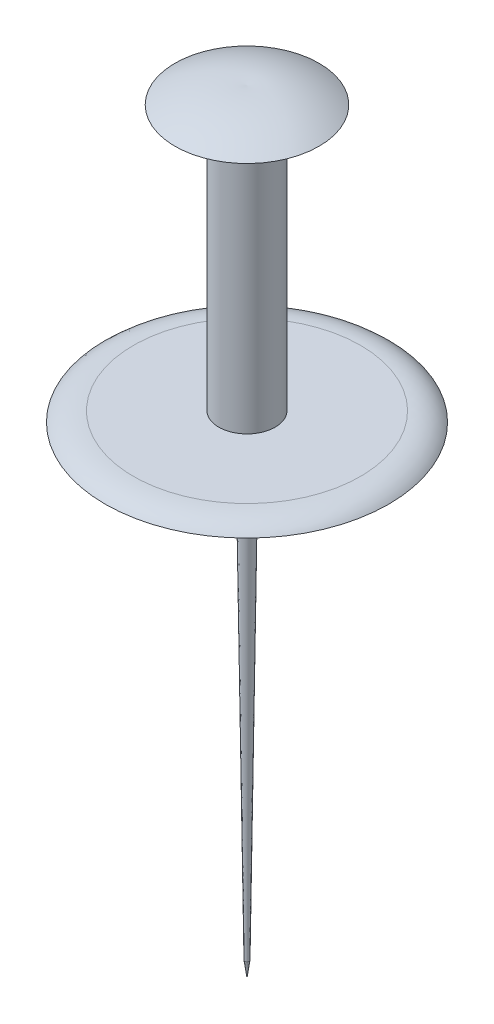
ISO-10303-21;
HEADER;
FILE_DESCRIPTION(('STEP AP214'),'2;1');
FILE_NAME('part.step','',(''),(''),'','','');
FILE_SCHEMA(('AUTOMOTIVE_DESIGN { 1 0 10303 214 1 1 1 1 }'));
ENDSEC;
DATA;
#1=APPLICATION_CONTEXT('core data for automotive mechanical design processes');
#2=APPLICATION_PROTOCOL_DEFINITION('international standard','automotive_design',2000,#1);
#3=PRODUCT_CONTEXT('',#1,'mechanical');
#4=PRODUCT('Part','Part','',(#3));
#5=PRODUCT_RELATED_PRODUCT_CATEGORY('part','',(#4));
#6=PRODUCT_DEFINITION_FORMATION('','',#4);
#7=PRODUCT_DEFINITION_CONTEXT('part definition',#1,'design');
#8=PRODUCT_DEFINITION('design','',#6,#7);
#9=PRODUCT_DEFINITION_SHAPE('','',#8);
#10=(LENGTH_UNIT() NAMED_UNIT(*) SI_UNIT(.MILLI.,.METRE.));
#11=(NAMED_UNIT(*) PLANE_ANGLE_UNIT() SI_UNIT($,.RADIAN.));
#12=(NAMED_UNIT(*) SI_UNIT($,.STERADIAN.) SOLID_ANGLE_UNIT());
#13=UNCERTAINTY_MEASURE_WITH_UNIT(LENGTH_MEASURE(1.E-05),#10,'distance_accuracy_value','');
#14=(GEOMETRIC_REPRESENTATION_CONTEXT(3) GLOBAL_UNCERTAINTY_ASSIGNED_CONTEXT((#13)) GLOBAL_UNIT_ASSIGNED_CONTEXT((#10,
#11,#12)) REPRESENTATION_CONTEXT('',''));
#15=CARTESIAN_POINT('',(0.,0.,0.));
#16=DIRECTION('',(0.,0.,1.));
#17=DIRECTION('',(1.,0.,0.));
#18=AXIS2_PLACEMENT_3D('',#15,#16,#17);
#19=CARTESIAN_POINT('',(0.,0.,0.));
#20=DIRECTION('',(0.,1.,0.));
#21=DIRECTION('',(0.,0.,1.));
#22=AXIS2_PLACEMENT_3D('',#19,#20,#21);
#23=CONICAL_SURFACE('',#22,0.,0.136982073280067);
#24=CARTESIAN_POINT('',(0.,1.40717055547446,0.));
#25=DIRECTION('',(0.,-1.,0.));
#26=DIRECTION('',(0.,0.,-1.));
#27=AXIS2_PLACEMENT_3D('',#24,#25,#26);
#28=CIRCLE('',#27,0.193971895815163);
#29=CARTESIAN_POINT('',(0.,1.40717055547446,-0.193971895815163));
#30=VERTEX_POINT('',#29);
#31=EDGE_CURVE('E11',#30,#30,#28,.T.);
#32=ORIENTED_EDGE('',*,*,#31,.T.);
#33=EDGE_LOOP('',(#32));
#34=FACE_BOUND('',#33,.T.);
#35=CARTESIAN_POINT('',(0.,0.,0.));
#36=VERTEX_POINT('',#35);
#37=VERTEX_LOOP('',#36);
#38=FACE_BOUND('',#37,.T.);
#39=ADVANCED_FACE('F33',(#34,#38),#23,.T.);
#40=CARTESIAN_POINT('',(0.,1.40717055547446,0.));
#41=DIRECTION('',(0.,1.,0.));
#42=DIRECTION('',(0.,0.,1.));
#43=AXIS2_PLACEMENT_3D('',#40,#41,#42);
#44=CONICAL_SURFACE('',#43,0.193971895815163,0.0131225649412625);
#45=CARTESIAN_POINT('',(0.,43.7243906526758,0.));
#46=DIRECTION('',(0.,-1.,0.));
#47=DIRECTION('',(0.,0.,-1.));
#48=AXIS2_PLACEMENT_3D('',#45,#46,#47);
#49=CIRCLE('',#48,0.749314242007679);
#50=CARTESIAN_POINT('',(0.,43.7243906526758,-0.749314242007679));
#51=VERTEX_POINT('',#50);
#52=EDGE_CURVE('E40',#51,#51,#49,.T.);
#53=ORIENTED_EDGE('',*,*,#52,.T.);
#54=EDGE_LOOP('',(#53));
#55=FACE_BOUND('',#54,.T.);
#56=ORIENTED_EDGE('',*,*,#31,.F.);
#57=EDGE_LOOP('',(#56));
#58=FACE_BOUND('',#57,.T.);
#59=ADVANCED_FACE('F76',(#55,#58),#44,.T.);
#60=CARTESIAN_POINT('',(0.749314242007679,43.7243906526758,0.));
#61=DIRECTION('',(0.,-1.,0.));
#62=DIRECTION('',(0.,0.,-1.));
#63=AXIS2_PLACEMENT_3D('',#60,#61,#62);
#64=PLANE('',#63);
#65=CARTESIAN_POINT('',(0.,43.7243906526758,0.));
#66=DIRECTION('',(0.,-1.,0.));
#67=DIRECTION('',(0.,0.,-1.));
#68=AXIS2_PLACEMENT_3D('',#65,#66,#67);
#69=CIRCLE('',#68,12.8860596808153);
#70=CARTESIAN_POINT('',(0.,43.7243906526758,-12.8860596808153));
#71=VERTEX_POINT('',#70);
#72=EDGE_CURVE('E71',#71,#71,#69,.T.);
#73=ORIENTED_EDGE('',*,*,#72,.T.);
#74=EDGE_LOOP('',(#73));
#75=FACE_BOUND('',#74,.T.);
#76=ORIENTED_EDGE('',*,*,#52,.F.);
#77=EDGE_LOOP('',(#76));
#78=FACE_BOUND('',#77,.T.);
#79=ADVANCED_FACE('F79',(#75,#78),#64,.T.);
#80=CARTESIAN_POINT('',(12.8860596808153,43.7243906526758,0.));
#81=CARTESIAN_POINT('',(12.0451446585334,44.6451987875991,0.));
#82=CARTESIAN_POINT('',(10.3167728594926,44.6240312083219,0.));
#83=B_SPLINE_CURVE_WITH_KNOTS('',2,(#80,#81,#82),.UNSPECIFIED.,.F.,.F.,(3,3),(0.,1.),.UNSPECIFIED.);
#84=CARTESIAN_POINT('',(0.,0.,0.));
#85=DIRECTION('',(0.,-1.,0.));
#86=AXIS1_PLACEMENT('',#84,#85);
#87=SURFACE_OF_REVOLUTION('',#83,#86);
#88=CARTESIAN_POINT('',(0.,44.6240312083219,0.));
#89=DIRECTION('',(0.,-1.,0.));
#90=DIRECTION('',(0.,0.,-1.));
#91=AXIS2_PLACEMENT_3D('',#88,#89,#90);
#92=CIRCLE('',#91,10.3167728594926);
#93=CARTESIAN_POINT('',(0.,44.6240312083219,-10.3167728594926));
#94=VERTEX_POINT('',#93);
#95=EDGE_CURVE('E68',#94,#94,#92,.T.);
#96=ORIENTED_EDGE('',*,*,#95,.T.);
#97=EDGE_LOOP('',(#96));
#98=FACE_BOUND('',#97,.T.);
#99=ORIENTED_EDGE('',*,*,#72,.F.);
#100=EDGE_LOOP('',(#99));
#101=FACE_BOUND('',#100,.T.);
#102=ADVANCED_FACE('F81',(#98,#101),#87,.F.);
#103=CARTESIAN_POINT('',(10.3167728594926,44.6240312083219,0.));
#104=DIRECTION('',(0.,1.,0.));
#105=DIRECTION('',(0.,0.,1.));
#106=AXIS2_PLACEMENT_3D('',#103,#104,#105);
#107=PLANE('',#106);
#108=CARTESIAN_POINT('',(0.,44.6240312083219,0.));
#109=DIRECTION('',(0.,-1.,0.));
#110=DIRECTION('',(0.,0.,-1.));
#111=AXIS2_PLACEMENT_3D('',#108,#109,#110);
#112=CIRCLE('',#111,2.56901076767924);
#113=CARTESIAN_POINT('',(0.,44.6240312083219,-2.56901076767924));
#114=VERTEX_POINT('',#113);
#115=EDGE_CURVE('E58',#114,#114,#112,.T.);
#116=ORIENTED_EDGE('',*,*,#115,.T.);
#117=EDGE_LOOP('',(#116));
#118=FACE_BOUND('',#117,.T.);
#119=ORIENTED_EDGE('',*,*,#95,.F.);
#120=EDGE_LOOP('',(#119));
#121=FACE_BOUND('',#120,.T.);
#122=ADVANCED_FACE('F88',(#118,#121),#107,.T.);
#123=CARTESIAN_POINT('',(0.,0.,0.));
#124=DIRECTION('',(0.,-1.,0.));
#125=DIRECTION('',(0.,0.,-1.));
#126=AXIS2_PLACEMENT_3D('',#123,#124,#125);
#127=CYLINDRICAL_SURFACE('',#126,2.56901076767924);
#128=CARTESIAN_POINT('',(0.,68.7115228760184,0.));
#129=DIRECTION('',(0.,-1.,0.));
#130=DIRECTION('',(0.,0.,-1.));
#131=AXIS2_PLACEMENT_3D('',#128,#129,#130);
#132=CIRCLE('',#131,2.56901076767924);
#133=CARTESIAN_POINT('',(0.,68.7115228760184,-2.56901076767924));
#134=VERTEX_POINT('',#133);
#135=EDGE_CURVE('E55',#134,#134,#132,.T.);
#136=ORIENTED_EDGE('',*,*,#135,.T.);
#137=EDGE_LOOP('',(#136));
#138=FACE_BOUND('',#137,.T.);
#139=ORIENTED_EDGE('',*,*,#115,.F.);
#140=EDGE_LOOP('',(#139));
#141=FACE_BOUND('',#140,.T.);
#142=ADVANCED_FACE('F119',(#138,#141),#127,.T.);
#143=CARTESIAN_POINT('',(2.56901076767924,68.7115228760184,0.));
#144=DIRECTION('',(0.,-1.,0.));
#145=DIRECTION('',(0.,0.,-1.));
#146=AXIS2_PLACEMENT_3D('',#143,#144,#145);
#147=PLANE('',#146);
#148=CARTESIAN_POINT('',(0.,68.7115228760184,0.));
#149=DIRECTION('',(0.,-1.,0.));
#150=DIRECTION('',(0.,0.,-1.));
#151=AXIS2_PLACEMENT_3D('',#148,#149,#150);
#152=CIRCLE('',#151,6.54249001615024);
#153=CARTESIAN_POINT('',(0.,68.7115228760184,-6.54249001615024));
#154=VERTEX_POINT('',#153);
#155=EDGE_CURVE('E53',#154,#154,#152,.T.);
#156=ORIENTED_EDGE('',*,*,#155,.T.);
#157=EDGE_LOOP('',(#156));
#158=FACE_BOUND('',#157,.T.);
#159=ORIENTED_EDGE('',*,*,#135,.F.);
#160=EDGE_LOOP('',(#159));
#161=FACE_BOUND('',#160,.T.);
#162=ADVANCED_FACE('F49',(#158,#161),#147,.T.);
#163=CARTESIAN_POINT('',(6.54249001615024,68.7115228760184,0.));
#164=CARTESIAN_POINT('',(3.42486488980277,70.5287080672073,0.));
#165=CARTESIAN_POINT('',(0.,70.258458907844,0.));
#166=B_SPLINE_CURVE_WITH_KNOTS('',2,(#163,#164,#165),.UNSPECIFIED.,.F.,.F.,(3,3),(0.,1.),.UNSPECIFIED.);
#167=CARTESIAN_POINT('',(0.,0.,0.));
#168=DIRECTION('',(0.,-1.,0.));
#169=AXIS1_PLACEMENT('',#167,#168);
#170=SURFACE_OF_REVOLUTION('',#166,#169);
#171=CARTESIAN_POINT('',(0.,70.258458907844,0.));
#172=VERTEX_POINT('',#171);
#173=VERTEX_LOOP('',#172);
#174=FACE_BOUND('',#173,.T.);
#175=ORIENTED_EDGE('',*,*,#155,.F.);
#176=EDGE_LOOP('',(#175));
#177=FACE_BOUND('',#176,.T.);
#178=ADVANCED_FACE('F46',(#174,#177),#170,.F.);
#179=CLOSED_SHELL('',(#39,#59,#79,#102,#122,#142,#162,#178));
#180=MANIFOLD_SOLID_BREP('B2',#179);
#181=ADVANCED_BREP_SHAPE_REPRESENTATION('',(#18,#180),#14);
#182=SHAPE_DEFINITION_REPRESENTATION(#9,#181);
ENDSEC;
END-ISO-10303-21;
